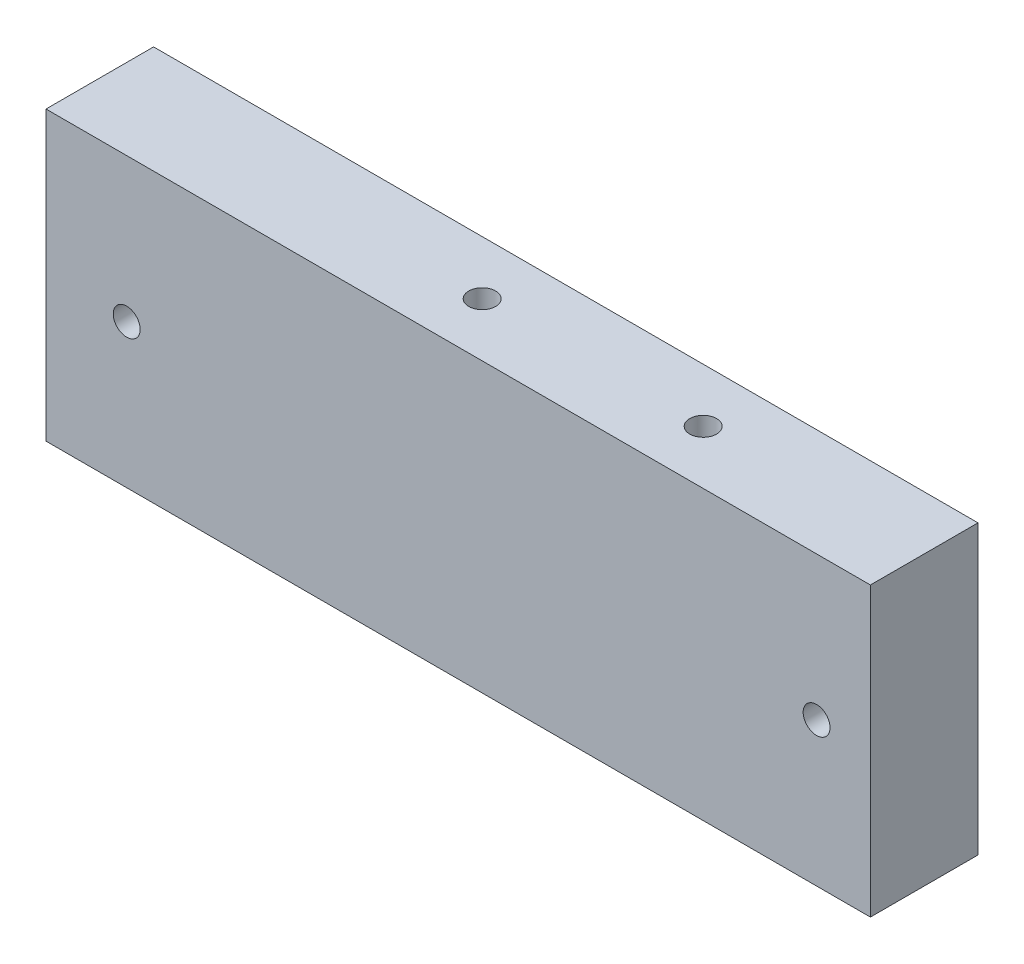
ISO-10303-21;
HEADER;
FILE_DESCRIPTION(('STEP AP214'),'2;1');
FILE_NAME('part.step','',(''),(''),'','','');
FILE_SCHEMA(('AUTOMOTIVE_DESIGN { 1 0 10303 214 1 1 1 1 }'));
ENDSEC;
DATA;
#1=APPLICATION_CONTEXT('core data for automotive mechanical design processes');
#2=APPLICATION_PROTOCOL_DEFINITION('international standard','automotive_design',2000,#1);
#3=PRODUCT_CONTEXT('',#1,'mechanical');
#4=PRODUCT('Part','Part','',(#3));
#5=PRODUCT_RELATED_PRODUCT_CATEGORY('part','',(#4));
#6=PRODUCT_DEFINITION_FORMATION('','',#4);
#7=PRODUCT_DEFINITION_CONTEXT('part definition',#1,'design');
#8=PRODUCT_DEFINITION('design','',#6,#7);
#9=PRODUCT_DEFINITION_SHAPE('','',#8);
#10=(LENGTH_UNIT() NAMED_UNIT(*) SI_UNIT(.MILLI.,.METRE.));
#11=(NAMED_UNIT(*) PLANE_ANGLE_UNIT() SI_UNIT($,.RADIAN.));
#12=(NAMED_UNIT(*) SI_UNIT($,.STERADIAN.) SOLID_ANGLE_UNIT());
#13=UNCERTAINTY_MEASURE_WITH_UNIT(LENGTH_MEASURE(1.E-05),#10,'distance_accuracy_value','');
#14=(GEOMETRIC_REPRESENTATION_CONTEXT(3) GLOBAL_UNCERTAINTY_ASSIGNED_CONTEXT((#13)) GLOBAL_UNIT_ASSIGNED_CONTEXT((#10,
#11,#12)) REPRESENTATION_CONTEXT('',''));
#15=CARTESIAN_POINT('',(0.,0.,0.));
#16=DIRECTION('',(0.,0.,1.));
#17=DIRECTION('',(1.,0.,0.));
#18=AXIS2_PLACEMENT_3D('',#15,#16,#17);
#19=CARTESIAN_POINT('',(-341.304465963194,-19.0499999999999,-12.6999999999998));
#20=DIRECTION('',(-1.,0.,0.));
#21=DIRECTION('',(0.,0.,1.00000000000001));
#22=AXIS2_PLACEMENT_3D('',#19,#20,#21);
#23=PLANE('',#22);
#24=DIRECTION('',(0.,-1.,0.));
#25=VECTOR('',#24,1.);
#26=CARTESIAN_POINT('',(-341.304465963193,-19.0499999999988,-1.31838984174237E-13));
#27=LINE('',#26,#25);
#28=CARTESIAN_POINT('',(-341.304465963193,-19.0499999999988,-1.31838984174237E-13));
#29=VERTEX_POINT('',#28);
#30=CARTESIAN_POINT('',(-341.304465963193,-52.9999999999984,2.23779328401008E-13));
#31=VERTEX_POINT('',#30);
#32=EDGE_CURVE('E143',#29,#31,#27,.T.);
#33=ORIENTED_EDGE('',*,*,#32,.F.);
#34=DIRECTION('',(0.,0.,1.00000000000001));
#35=VECTOR('',#34,1.);
#36=CARTESIAN_POINT('',(-341.304465963194,-19.0499999999999,-12.6999999999998));
#37=LINE('',#36,#35);
#38=CARTESIAN_POINT('',(-341.304465963194,-19.0499999999999,-12.6999999999998));
#39=VERTEX_POINT('',#38);
#40=EDGE_CURVE('E11',#39,#29,#37,.T.);
#41=ORIENTED_EDGE('',*,*,#40,.F.);
#42=DIRECTION('',(0.,-1.,0.));
#43=VECTOR('',#42,1.);
#44=CARTESIAN_POINT('',(-341.304465963194,-19.0499999999999,-12.6999999999998));
#45=LINE('',#44,#43);
#46=CARTESIAN_POINT('',(-341.304465963193,-52.9999999999994,-12.7000000000002));
#47=VERTEX_POINT('',#46);
#48=EDGE_CURVE('E134',#39,#47,#45,.T.);
#49=ORIENTED_EDGE('',*,*,#48,.T.);
#50=DIRECTION('',(0.,0.,1.00000000000001));
#51=VECTOR('',#50,1.);
#52=CARTESIAN_POINT('',(-341.304465963193,-52.9999999999994,-12.7000000000002));
#53=LINE('',#52,#51);
#54=EDGE_CURVE('E84',#47,#31,#53,.T.);
#55=ORIENTED_EDGE('',*,*,#54,.T.);
#56=EDGE_LOOP('',(#33,#41,#49,#55));
#57=FACE_BOUND('',#56,.T.);
#58=ADVANCED_FACE('F40',(#57),#23,.T.);
#59=CARTESIAN_POINT('',(-341.304465963194,-19.0499999999999,-12.6999999999998));
#60=DIRECTION('',(0.,1.,0.));
#61=DIRECTION('',(-1.,0.,0.));
#62=AXIS2_PLACEMENT_3D('',#59,#60,#61);
#63=PLANE('',#62);
#64=CARTESIAN_POINT('',(-270.087799296526,-19.0499999999995,-6.34999999999992));
#65=DIRECTION('',(0.,1.,0.));
#66=DIRECTION('',(-1.,0.,0.));
#67=AXIS2_PLACEMENT_3D('',#64,#65,#66);
#68=CIRCLE('',#67,1.58750000000002);
#69=CARTESIAN_POINT('',(-271.675299296526,-19.0499999999995,-6.34999999999992));
#70=VERTEX_POINT('',#69);
#71=EDGE_CURVE('E160',#70,#70,#68,.T.);
#72=ORIENTED_EDGE('',*,*,#71,.F.);
#73=EDGE_LOOP('',(#72));
#74=FACE_BOUND('',#73,.T.);
#75=CARTESIAN_POINT('',(-296.17113262986,-19.0500000000001,-6.34999999999996));
#76=DIRECTION('',(0.,1.,0.));
#77=DIRECTION('',(-1.,0.,0.));
#78=AXIS2_PLACEMENT_3D('',#75,#76,#77);
#79=CIRCLE('',#78,1.58750000000002);
#80=CARTESIAN_POINT('',(-297.75863262986,-19.0500000000001,-6.34999999999996));
#81=VERTEX_POINT('',#80);
#82=EDGE_CURVE('E147',#81,#81,#79,.T.);
#83=ORIENTED_EDGE('',*,*,#82,.F.);
#84=EDGE_LOOP('',(#83));
#85=FACE_BOUND('',#84,.T.);
#86=DIRECTION('',(-1.,0.,0.));
#87=VECTOR('',#86,1.);
#88=CARTESIAN_POINT('',(-341.304465963193,-19.0499999999988,-1.31838984174237E-13));
#89=LINE('',#88,#87);
#90=CARTESIAN_POINT('',(-244.004465963193,-19.0499999999993,-2.63677968348475E-13));
#91=VERTEX_POINT('',#90);
#92=EDGE_CURVE('E137',#91,#29,#89,.T.);
#93=ORIENTED_EDGE('',*,*,#92,.F.);
#94=DIRECTION('',(0.,0.,1.00000000000001));
#95=VECTOR('',#94,1.);
#96=CARTESIAN_POINT('',(-244.004465963193,-19.0499999999996,-12.7000000000003));
#97=LINE('',#96,#95);
#98=CARTESIAN_POINT('',(-244.004465963193,-19.0499999999996,-12.7000000000003));
#99=VERTEX_POINT('',#98);
#100=EDGE_CURVE('E49',#99,#91,#97,.T.);
#101=ORIENTED_EDGE('',*,*,#100,.F.);
#102=DIRECTION('',(-1.,0.,0.));
#103=VECTOR('',#102,1.);
#104=CARTESIAN_POINT('',(-341.304465963194,-19.0499999999999,-12.6999999999998));
#105=LINE('',#104,#103);
#106=EDGE_CURVE('E141',#99,#39,#105,.T.);
#107=ORIENTED_EDGE('',*,*,#106,.T.);
#108=ORIENTED_EDGE('',*,*,#40,.T.);
#109=EDGE_LOOP('',(#93,#101,#107,#108));
#110=FACE_BOUND('',#109,.T.);
#111=ADVANCED_FACE('F182',(#74,#85,#110),#63,.T.);
#112=CARTESIAN_POINT('',(-244.004465963193,-19.0499999999996,-12.7000000000003));
#113=DIRECTION('',(1.,0.,0.));
#114=DIRECTION('',(0.,0.,-1.00000000000001));
#115=AXIS2_PLACEMENT_3D('',#112,#113,#114);
#116=PLANE('',#115);
#117=DIRECTION('',(0.,1.,0.));
#118=VECTOR('',#117,1.);
#119=CARTESIAN_POINT('',(-244.004465963193,-19.0499999999993,-2.63677968348475E-13));
#120=LINE('',#119,#118);
#121=CARTESIAN_POINT('',(-244.004465963193,-52.9999999999999,-2.23779328401008E-13));
#122=VERTEX_POINT('',#121);
#123=EDGE_CURVE('E150',#122,#91,#120,.T.);
#124=ORIENTED_EDGE('',*,*,#123,.F.);
#125=DIRECTION('',(0.,0.,1.00000000000001));
#126=VECTOR('',#125,1.);
#127=CARTESIAN_POINT('',(-244.004465963193,-52.9999999999993,-12.7000000000005));
#128=LINE('',#127,#126);
#129=CARTESIAN_POINT('',(-244.004465963193,-52.9999999999993,-12.7000000000005));
#130=VERTEX_POINT('',#129);
#131=EDGE_CURVE('E155',#130,#122,#128,.T.);
#132=ORIENTED_EDGE('',*,*,#131,.F.);
#133=DIRECTION('',(0.,1.,0.));
#134=VECTOR('',#133,1.);
#135=CARTESIAN_POINT('',(-244.004465963193,-19.0499999999996,-12.7000000000003));
#136=LINE('',#135,#134);
#137=EDGE_CURVE('E139',#130,#99,#136,.T.);
#138=ORIENTED_EDGE('',*,*,#137,.T.);
#139=ORIENTED_EDGE('',*,*,#100,.T.);
#140=EDGE_LOOP('',(#124,#132,#138,#139));
#141=FACE_BOUND('',#140,.T.);
#142=ADVANCED_FACE('F181',(#141),#116,.T.);
#143=CARTESIAN_POINT('',(-341.304465963193,-52.9999999999994,-12.7000000000002));
#144=DIRECTION('',(0.,-1.,0.));
#145=DIRECTION('',(1.,0.,0.));
#146=AXIS2_PLACEMENT_3D('',#143,#144,#145);
#147=PLANE('',#146);
#148=CARTESIAN_POINT('',(-296.17113262986,-53.,-6.3499999999993));
#149=DIRECTION('',(0.,-1.,0.));
#150=DIRECTION('',(1.,0.,0.));
#151=AXIS2_PLACEMENT_3D('',#148,#149,#150);
#152=CIRCLE('',#151,1.58750000000002);
#153=CARTESIAN_POINT('',(-294.58363262986,-53.,-6.3499999999993));
#154=VERTEX_POINT('',#153);
#155=EDGE_CURVE('E129',#154,#154,#152,.T.);
#156=ORIENTED_EDGE('',*,*,#155,.F.);
#157=EDGE_LOOP('',(#156));
#158=FACE_BOUND('',#157,.T.);
#159=CARTESIAN_POINT('',(-270.087799296527,-52.9999999999998,-6.35000000000019));
#160=DIRECTION('',(0.,-1.,0.));
#161=DIRECTION('',(1.,0.,0.));
#162=AXIS2_PLACEMENT_3D('',#159,#160,#161);
#163=CIRCLE('',#162,1.58750000000002);
#164=CARTESIAN_POINT('',(-268.500299296527,-52.9999999999998,-6.35000000000019));
#165=VERTEX_POINT('',#164);
#166=EDGE_CURVE('E133',#165,#165,#163,.T.);
#167=ORIENTED_EDGE('',*,*,#166,.F.);
#168=EDGE_LOOP('',(#167));
#169=FACE_BOUND('',#168,.T.);
#170=DIRECTION('',(1.,0.,0.));
#171=VECTOR('',#170,1.);
#172=CARTESIAN_POINT('',(-341.304465963193,-52.9999999999984,2.23779328401008E-13));
#173=LINE('',#172,#171);
#174=EDGE_CURVE('E146',#31,#122,#173,.T.);
#175=ORIENTED_EDGE('',*,*,#174,.F.);
#176=ORIENTED_EDGE('',*,*,#54,.F.);
#177=DIRECTION('',(1.,0.,0.));
#178=VECTOR('',#177,1.);
#179=CARTESIAN_POINT('',(-341.304465963193,-52.9999999999994,-12.7000000000002));
#180=LINE('',#179,#178);
#181=EDGE_CURVE('E136',#47,#130,#180,.T.);
#182=ORIENTED_EDGE('',*,*,#181,.T.);
#183=ORIENTED_EDGE('',*,*,#131,.T.);
#184=EDGE_LOOP('',(#175,#176,#182,#183));
#185=FACE_BOUND('',#184,.T.);
#186=ADVANCED_FACE('F179',(#158,#169,#185),#147,.T.);
#187=CARTESIAN_POINT('',(1.31838984174237E-12,8.04911692853238E-13,-12.7000000000006));
#188=DIRECTION('',(0.,0.,1.00000000000001));
#189=DIRECTION('',(1.,0.,0.));
#190=AXIS2_PLACEMENT_3D('',#187,#188,#189);
#191=PLANE('',#190);
#192=CARTESIAN_POINT('',(-250.354465963193,-36.0249999999992,-12.7000000000003));
#193=DIRECTION('',(0.,0.,-1.00000000000001));
#194=DIRECTION('',(-1.,0.,0.));
#195=AXIS2_PLACEMENT_3D('',#192,#193,#194);
#196=CIRCLE('',#195,5.08);
#197=CARTESIAN_POINT('',(-255.434465963193,-36.0249999999992,-12.7000000000003));
#198=VERTEX_POINT('',#197);
#199=EDGE_CURVE('E111',#198,#198,#196,.T.);
#200=ORIENTED_EDGE('',*,*,#199,.F.);
#201=EDGE_LOOP('',(#200));
#202=FACE_BOUND('',#201,.T.);
#203=CARTESIAN_POINT('',(-331.779465963193,-36.0249999999996,-12.7000000000004));
#204=DIRECTION('',(0.,0.,-1.00000000000001));
#205=DIRECTION('',(-1.,0.,0.));
#206=AXIS2_PLACEMENT_3D('',#203,#204,#205);
#207=CIRCLE('',#206,5.08000000000003);
#208=CARTESIAN_POINT('',(-336.859465963193,-36.0249999999996,-12.7000000000004));
#209=VERTEX_POINT('',#208);
#210=EDGE_CURVE('E119',#209,#209,#207,.T.);
#211=ORIENTED_EDGE('',*,*,#210,.F.);
#212=EDGE_LOOP('',(#211));
#213=FACE_BOUND('',#212,.T.);
#214=ORIENTED_EDGE('',*,*,#48,.F.);
#215=ORIENTED_EDGE('',*,*,#106,.F.);
#216=ORIENTED_EDGE('',*,*,#137,.F.);
#217=ORIENTED_EDGE('',*,*,#181,.F.);
#218=EDGE_LOOP('',(#214,#215,#216,#217));
#219=FACE_BOUND('',#218,.T.);
#220=ADVANCED_FACE('F176',(#202,#213,#219),#191,.F.);
#221=CARTESIAN_POINT('',(0.,0.,0.));
#222=DIRECTION('',(0.,0.,1.00000000000001));
#223=DIRECTION('',(1.,0.,0.));
#224=AXIS2_PLACEMENT_3D('',#221,#222,#223);
#225=PLANE('',#224);
#226=CARTESIAN_POINT('',(-250.354465963193,-36.0249999999986,-3.38271077815477E-13));
#227=DIRECTION('',(0.,0.,1.00000000000001));
#228=DIRECTION('',(1.,0.,0.));
#229=AXIS2_PLACEMENT_3D('',#226,#227,#228);
#230=CIRCLE('',#229,1.58750000000002);
#231=CARTESIAN_POINT('',(-248.766965963193,-36.0249999999986,-3.39769185009331E-13));
#232=VERTEX_POINT('',#231);
#233=EDGE_CURVE('E43',#232,#232,#230,.T.);
#234=ORIENTED_EDGE('',*,*,#233,.F.);
#235=EDGE_LOOP('',(#234));
#236=FACE_BOUND('',#235,.T.);
#237=CARTESIAN_POINT('',(-331.779465963194,-36.0249999999984,-1.76941794549634E-13));
#238=DIRECTION('',(0.,0.,1.00000000000001));
#239=DIRECTION('',(1.,0.,0.));
#240=AXIS2_PLACEMENT_3D('',#237,#238,#239);
#241=CIRCLE('',#240,1.58750000000005);
#242=CARTESIAN_POINT('',(-330.191965963194,-36.0249999999984,-1.78439901743488E-13));
#243=VERTEX_POINT('',#242);
#244=EDGE_CURVE('E125',#243,#243,#241,.T.);
#245=ORIENTED_EDGE('',*,*,#244,.F.);
#246=EDGE_LOOP('',(#245));
#247=FACE_BOUND('',#246,.T.);
#248=ORIENTED_EDGE('',*,*,#32,.T.);
#249=ORIENTED_EDGE('',*,*,#174,.T.);
#250=ORIENTED_EDGE('',*,*,#123,.T.);
#251=ORIENTED_EDGE('',*,*,#92,.T.);
#252=EDGE_LOOP('',(#248,#249,#250,#251));
#253=FACE_BOUND('',#252,.T.);
#254=ADVANCED_FACE('F172',(#236,#247,#253),#225,.T.);
#255=CARTESIAN_POINT('',(-296.17113262986,1.66533453693773E-12,-6.34999999999991));
#256=DIRECTION('',(0.,1.,0.));
#257=DIRECTION('',(0.,0.,1.00000000000001));
#258=AXIS2_PLACEMENT_3D('',#255,#256,#257);
#259=CYLINDRICAL_SURFACE('',#258,1.58750000000002);
#260=ORIENTED_EDGE('',*,*,#82,.T.);
#261=EDGE_LOOP('',(#260));
#262=FACE_BOUND('',#261,.T.);
#263=CARTESIAN_POINT('',(-296.171132629844,-38.0999999999995,-6.35000000001147));
#264=DIRECTION('',(0.,1.,0.));
#265=DIRECTION('',(0.,0.,1.00000000000001));
#266=AXIS2_PLACEMENT_3D('',#263,#264,#265);
#267=CIRCLE('',#266,1.58750000000002);
#268=CARTESIAN_POINT('',(-296.171132629844,-38.0999999999995,-4.76250000001143));
#269=VERTEX_POINT('',#268);
#270=EDGE_CURVE('E108',#269,#269,#267,.T.);
#271=ORIENTED_EDGE('',*,*,#270,.F.);
#272=EDGE_LOOP('',(#271));
#273=FACE_BOUND('',#272,.T.);
#274=ADVANCED_FACE('F175',(#262,#273),#259,.F.);
#275=CARTESIAN_POINT('',(-270.087799296527,2.94209101525666E-12,-6.35000000000009));
#276=DIRECTION('',(0.,1.,0.));
#277=DIRECTION('',(0.,0.,1.00000000000001));
#278=AXIS2_PLACEMENT_3D('',#275,#276,#277);
#279=CYLINDRICAL_SURFACE('',#278,1.58750000000002);
#280=ORIENTED_EDGE('',*,*,#71,.T.);
#281=EDGE_LOOP('',(#280));
#282=FACE_BOUND('',#281,.T.);
#283=CARTESIAN_POINT('',(-270.087799296511,-38.0999999999987,-6.35000000001109));
#284=DIRECTION('',(0.,1.,0.));
#285=DIRECTION('',(0.,0.,1.00000000000001));
#286=AXIS2_PLACEMENT_3D('',#283,#284,#285);
#287=CIRCLE('',#286,1.58750000000002);
#288=CARTESIAN_POINT('',(-270.087799296511,-38.0999999999987,-4.76250000001105));
#289=VERTEX_POINT('',#288);
#290=EDGE_CURVE('E106',#289,#289,#287,.T.);
#291=ORIENTED_EDGE('',*,*,#290,.F.);
#292=EDGE_LOOP('',(#291));
#293=FACE_BOUND('',#292,.T.);
#294=ADVANCED_FACE('F211',(#282,#293),#279,.F.);
#295=CARTESIAN_POINT('',(-270.087799296527,-40.2999999999972,-6.34999999999987));
#296=DIRECTION('',(0.,-1.,0.));
#297=DIRECTION('',(0.,0.,-1.00000000000001));
#298=AXIS2_PLACEMENT_3D('',#295,#296,#297);
#299=CONICAL_SURFACE('',#298,1.58750000000002,1.02974425867666);
#300=CARTESIAN_POINT('',(-270.087799296527,-39.3461337672918,-6.34999999999986));
#301=VERTEX_POINT('',#300);
#302=VERTEX_LOOP('',#301);
#303=FACE_BOUND('',#302,.T.);
#304=CARTESIAN_POINT('',(-270.087799296527,-40.2999999999972,-6.34999999999987));
#305=DIRECTION('',(0.,-1.,0.));
#306=DIRECTION('',(0.,0.,-1.00000000000001));
#307=AXIS2_PLACEMENT_3D('',#304,#305,#306);
#308=CIRCLE('',#307,1.58750000000002);
#309=CARTESIAN_POINT('',(-270.087799296527,-40.2999999999972,-7.93749999999991));
#310=VERTEX_POINT('',#309);
#311=EDGE_CURVE('E130',#310,#310,#308,.T.);
#312=ORIENTED_EDGE('',*,*,#311,.T.);
#313=EDGE_LOOP('',(#312));
#314=FACE_BOUND('',#313,.T.);
#315=ADVANCED_FACE('F245',(#303,#314),#299,.F.);
#316=CARTESIAN_POINT('',(-270.087799296527,-72.0499999999982,-6.35000000000004));
#317=DIRECTION('',(0.,-1.,0.));
#318=DIRECTION('',(0.,0.,-1.00000000000001));
#319=AXIS2_PLACEMENT_3D('',#316,#317,#318);
#320=CYLINDRICAL_SURFACE('',#319,1.58750000000002);
#321=ORIENTED_EDGE('',*,*,#166,.T.);
#322=EDGE_LOOP('',(#321));
#323=FACE_BOUND('',#322,.T.);
#324=ORIENTED_EDGE('',*,*,#311,.F.);
#325=EDGE_LOOP('',(#324));
#326=FACE_BOUND('',#325,.T.);
#327=ADVANCED_FACE('F241',(#323,#326),#320,.F.);
#328=CARTESIAN_POINT('',(-296.17113262986,-40.2999999999983,-6.34999999999932));
#329=DIRECTION('',(0.,-1.,0.));
#330=DIRECTION('',(0.,0.,-1.00000000000001));
#331=AXIS2_PLACEMENT_3D('',#328,#329,#330);
#332=CONICAL_SURFACE('',#331,1.58750000000002,1.02974425867666);
#333=CARTESIAN_POINT('',(-296.171132629861,-39.3461337672917,-6.34999999999942));
#334=VERTEX_POINT('',#333);
#335=VERTEX_LOOP('',#334);
#336=FACE_BOUND('',#335,.T.);
#337=CARTESIAN_POINT('',(-296.17113262986,-40.2999999999983,-6.34999999999932));
#338=DIRECTION('',(0.,-1.,0.));
#339=DIRECTION('',(0.,0.,-1.00000000000001));
#340=AXIS2_PLACEMENT_3D('',#337,#338,#339);
#341=CIRCLE('',#340,1.58750000000002);
#342=CARTESIAN_POINT('',(-296.17113262986,-40.2999999999983,-7.93749999999936));
#343=VERTEX_POINT('',#342);
#344=EDGE_CURVE('E126',#343,#343,#341,.T.);
#345=ORIENTED_EDGE('',*,*,#344,.T.);
#346=EDGE_LOOP('',(#345));
#347=FACE_BOUND('',#346,.T.);
#348=ADVANCED_FACE('F237',(#336,#347),#332,.F.);
#349=CARTESIAN_POINT('',(-296.171132629861,-72.0499999999978,-6.34999999999951));
#350=DIRECTION('',(0.,-1.,0.));
#351=DIRECTION('',(0.,0.,-1.00000000000001));
#352=AXIS2_PLACEMENT_3D('',#349,#350,#351);
#353=CYLINDRICAL_SURFACE('',#352,1.58750000000002);
#354=ORIENTED_EDGE('',*,*,#155,.T.);
#355=EDGE_LOOP('',(#354));
#356=FACE_BOUND('',#355,.T.);
#357=ORIENTED_EDGE('',*,*,#344,.F.);
#358=EDGE_LOOP('',(#357));
#359=FACE_BOUND('',#358,.T.);
#360=ADVANCED_FACE('F234',(#356,#359),#353,.F.);
#361=CARTESIAN_POINT('',(-331.779465963193,-36.0249999999996,-12.7000000000004));
#362=DIRECTION('',(0.,0.,-1.00000000000001));
#363=DIRECTION('',(-1.,0.,0.));
#364=AXIS2_PLACEMENT_3D('',#361,#362,#363);
#365=CYLINDRICAL_SURFACE('',#364,1.58750000000005);
#366=ORIENTED_EDGE('',*,*,#244,.T.);
#367=EDGE_LOOP('',(#366));
#368=FACE_BOUND('',#367,.T.);
#369=CARTESIAN_POINT('',(-331.779465963194,-36.0249999999983,-8.68233833778111));
#370=DIRECTION('',(0.,0.,-1.00000000000001));
#371=DIRECTION('',(-1.,0.,0.));
#372=AXIS2_PLACEMENT_3D('',#369,#370,#371);
#373=CIRCLE('',#372,1.58750000000007);
#374=CARTESIAN_POINT('',(-333.366965963194,-36.0249999999983,-8.68233833778111));
#375=VERTEX_POINT('',#374);
#376=EDGE_CURVE('E122',#375,#375,#373,.T.);
#377=ORIENTED_EDGE('',*,*,#376,.T.);
#378=EDGE_LOOP('',(#377));
#379=FACE_BOUND('',#378,.T.);
#380=ADVANCED_FACE('F169',(#368,#379),#365,.F.);
#381=CARTESIAN_POINT('',(-331.779465963193,-36.0249999999996,-12.7000000000004));
#382=DIRECTION('',(0.,0.,-1.00000000000001));
#383=DIRECTION('',(-1.,0.,0.));
#384=AXIS2_PLACEMENT_3D('',#381,#382,#383);
#385=CONICAL_SURFACE('',#384,5.08000000000003,0.715584993317686);
#386=ORIENTED_EDGE('',*,*,#376,.F.);
#387=EDGE_LOOP('',(#386));
#388=FACE_BOUND('',#387,.T.);
#389=ORIENTED_EDGE('',*,*,#210,.T.);
#390=EDGE_LOOP('',(#389));
#391=FACE_BOUND('',#390,.T.);
#392=ADVANCED_FACE('F227',(#388,#391),#385,.F.);
#393=CARTESIAN_POINT('',(-250.354465963193,-36.0249999999992,-12.7000000000003));
#394=DIRECTION('',(0.,0.,-1.00000000000001));
#395=DIRECTION('',(-1.,0.,0.));
#396=AXIS2_PLACEMENT_3D('',#393,#394,#395);
#397=CYLINDRICAL_SURFACE('',#396,1.58750000000002);
#398=ORIENTED_EDGE('',*,*,#233,.T.);
#399=EDGE_LOOP('',(#398));
#400=FACE_BOUND('',#399,.T.);
#401=CARTESIAN_POINT('',(-250.354465963193,-36.0249999999982,-8.68233833778114));
#402=DIRECTION('',(0.,0.,-1.00000000000001));
#403=DIRECTION('',(-1.,0.,0.));
#404=AXIS2_PLACEMENT_3D('',#401,#402,#403);
#405=CIRCLE('',#404,1.58750000000005);
#406=CARTESIAN_POINT('',(-251.941965963193,-36.0249999999982,-8.68233833778114));
#407=VERTEX_POINT('',#406);
#408=EDGE_CURVE('E116',#407,#407,#405,.T.);
#409=ORIENTED_EDGE('',*,*,#408,.T.);
#410=EDGE_LOOP('',(#409));
#411=FACE_BOUND('',#410,.T.);
#412=ADVANCED_FACE('F221',(#400,#411),#397,.F.);
#413=CARTESIAN_POINT('',(-250.354465963193,-36.0249999999992,-12.7000000000003));
#414=DIRECTION('',(0.,0.,-1.00000000000001));
#415=DIRECTION('',(-1.,0.,0.));
#416=AXIS2_PLACEMENT_3D('',#413,#414,#415);
#417=CONICAL_SURFACE('',#416,5.08,0.715584993317686);
#418=ORIENTED_EDGE('',*,*,#408,.F.);
#419=EDGE_LOOP('',(#418));
#420=FACE_BOUND('',#419,.T.);
#421=ORIENTED_EDGE('',*,*,#199,.T.);
#422=EDGE_LOOP('',(#421));
#423=FACE_BOUND('',#422,.T.);
#424=ADVANCED_FACE('F215',(#420,#423),#417,.F.);
#425=CARTESIAN_POINT('',(-296.171132629844,-38.0999999999995,-6.35000000001147));
#426=DIRECTION('',(0.,1.,0.));
#427=DIRECTION('',(0.,0.,1.00000000000001));
#428=AXIS2_PLACEMENT_3D('',#425,#426,#427);
#429=CONICAL_SURFACE('',#428,1.58750000000002,1.02974425867666);
#430=CARTESIAN_POINT('',(-296.171132629844,-39.0538662327053,-6.35000000001125));
#431=VERTEX_POINT('',#430);
#432=VERTEX_LOOP('',#431);
#433=FACE_BOUND('',#432,.T.);
#434=ORIENTED_EDGE('',*,*,#270,.T.);
#435=EDGE_LOOP('',(#434));
#436=FACE_BOUND('',#435,.T.);
#437=ADVANCED_FACE('F102',(#433,#436),#429,.F.);
#438=CARTESIAN_POINT('',(-270.087799296511,-38.0999999999987,-6.35000000001109));
#439=DIRECTION('',(0.,1.,0.));
#440=DIRECTION('',(0.,0.,1.00000000000001));
#441=AXIS2_PLACEMENT_3D('',#438,#439,#440);
#442=CONICAL_SURFACE('',#441,1.58750000000002,1.02974425867666);
#443=CARTESIAN_POINT('',(-270.087799296511,-39.0538662327045,-6.3500000000113));
#444=VERTEX_POINT('',#443);
#445=VERTEX_LOOP('',#444);
#446=FACE_BOUND('',#445,.T.);
#447=ORIENTED_EDGE('',*,*,#290,.T.);
#448=EDGE_LOOP('',(#447));
#449=FACE_BOUND('',#448,.T.);
#450=ADVANCED_FACE('F99',(#446,#449),#442,.F.);
#451=CLOSED_SHELL('',(#58,#111,#142,#186,#220,#254,#274,#294,#315,#327,#348,#360,#380,#392,#412,
#424,#437,#450));
#452=MANIFOLD_SOLID_BREP('B2',#451);
#453=ADVANCED_BREP_SHAPE_REPRESENTATION('',(#18,#452),#14);
#454=SHAPE_DEFINITION_REPRESENTATION(#9,#453);
ENDSEC;
END-ISO-10303-21;
